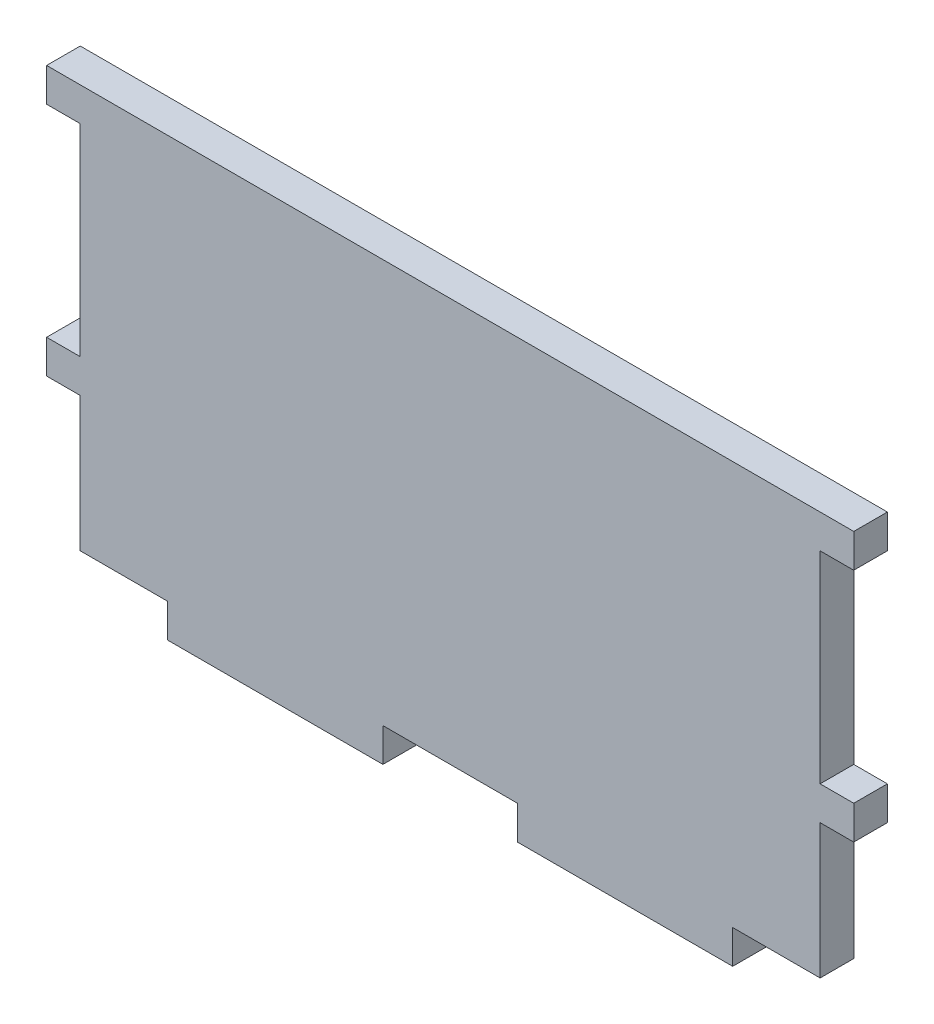
ISO-10303-21;
HEADER;
FILE_DESCRIPTION(('STEP AP214'),'2;1');
FILE_NAME('part.step','',(''),(''),'','','');
FILE_SCHEMA(('AUTOMOTIVE_DESIGN { 1 0 10303 214 1 1 1 1 }'));
ENDSEC;
DATA;
#1=APPLICATION_CONTEXT('core data for automotive mechanical design processes');
#2=APPLICATION_PROTOCOL_DEFINITION('international standard','automotive_design',2000,#1);
#3=PRODUCT_CONTEXT('',#1,'mechanical');
#4=PRODUCT('Part','Part','',(#3));
#5=PRODUCT_RELATED_PRODUCT_CATEGORY('part','',(#4));
#6=PRODUCT_DEFINITION_FORMATION('','',#4);
#7=PRODUCT_DEFINITION_CONTEXT('part definition',#1,'design');
#8=PRODUCT_DEFINITION('design','',#6,#7);
#9=PRODUCT_DEFINITION_SHAPE('','',#8);
#10=(LENGTH_UNIT() NAMED_UNIT(*) SI_UNIT(.MILLI.,.METRE.));
#11=(NAMED_UNIT(*) PLANE_ANGLE_UNIT() SI_UNIT($,.RADIAN.));
#12=(NAMED_UNIT(*) SI_UNIT($,.STERADIAN.) SOLID_ANGLE_UNIT());
#13=UNCERTAINTY_MEASURE_WITH_UNIT(LENGTH_MEASURE(1.E-05),#10,'distance_accuracy_value','');
#14=(GEOMETRIC_REPRESENTATION_CONTEXT(3) GLOBAL_UNCERTAINTY_ASSIGNED_CONTEXT((#13)) GLOBAL_UNIT_ASSIGNED_CONTEXT((#10,
#11,#12)) REPRESENTATION_CONTEXT('',''));
#15=CARTESIAN_POINT('',(0.,0.,0.));
#16=DIRECTION('',(0.,0.,1.));
#17=DIRECTION('',(1.,0.,0.));
#18=AXIS2_PLACEMENT_3D('',#15,#16,#17);
#19=CARTESIAN_POINT('',(34.925,-19.05,3.175));
#20=DIRECTION('',(0.,1.,0.));
#21=DIRECTION('',(-1.,0.,0.));
#22=AXIS2_PLACEMENT_3D('',#19,#20,#21);
#23=PLANE('',#22);
#24=DIRECTION('',(0.,0.,1.));
#25=VECTOR('',#24,1.);
#26=CARTESIAN_POINT('',(26.67,-19.05,3.17500000000001));
#27=LINE('',#26,#25);
#28=CARTESIAN_POINT('',(26.67,-19.05,0.));
#29=VERTEX_POINT('',#28);
#30=CARTESIAN_POINT('',(26.67,-19.05,3.175));
#31=VERTEX_POINT('',#30);
#32=EDGE_CURVE('E216',#29,#31,#27,.T.);
#33=ORIENTED_EDGE('',*,*,#32,.F.);
#34=DIRECTION('',(1.,0.,0.));
#35=VECTOR('',#34,1.);
#36=CARTESIAN_POINT('',(34.925,-19.05,0.));
#37=LINE('',#36,#35);
#38=CARTESIAN_POINT('',(34.925,-19.05,0.));
#39=VERTEX_POINT('',#38);
#40=EDGE_CURVE('E362',#29,#39,#37,.T.);
#41=ORIENTED_EDGE('',*,*,#40,.T.);
#42=DIRECTION('',(0.,0.,-1.));
#43=VECTOR('',#42,1.);
#44=CARTESIAN_POINT('',(34.925,-19.05,3.175));
#45=LINE('',#44,#43);
#46=CARTESIAN_POINT('',(34.925,-19.05,3.175));
#47=VERTEX_POINT('',#46);
#48=EDGE_CURVE('E41',#47,#39,#45,.T.);
#49=ORIENTED_EDGE('',*,*,#48,.F.);
#50=DIRECTION('',(1.,0.,0.));
#51=VECTOR('',#50,1.);
#52=CARTESIAN_POINT('',(34.925,-19.05,3.175));
#53=LINE('',#52,#51);
#54=EDGE_CURVE('E48',#31,#47,#53,.T.);
#55=ORIENTED_EDGE('',*,*,#54,.F.);
#56=EDGE_LOOP('',(#33,#41,#49,#55));
#57=FACE_BOUND('',#56,.T.);
#58=ADVANCED_FACE('F33',(#57),#23,.F.);
#59=DIRECTION('',(0.,0.,-1.));
#60=VECTOR('',#59,1.);
#61=CARTESIAN_POINT('',(6.35,-19.05,3.175));
#62=LINE('',#61,#60);
#63=CARTESIAN_POINT('',(6.35,-19.05,3.175));
#64=VERTEX_POINT('',#63);
#65=CARTESIAN_POINT('',(6.35,-19.05,0.));
#66=VERTEX_POINT('',#65);
#67=EDGE_CURVE('E56',#64,#66,#62,.T.);
#68=ORIENTED_EDGE('',*,*,#67,.F.);
#69=CARTESIAN_POINT('',(-6.34999999999999,-19.05,3.175));
#70=VERTEX_POINT('',#69);
#71=EDGE_CURVE('E354',#70,#64,#53,.T.);
#72=ORIENTED_EDGE('',*,*,#71,.F.);
#73=DIRECTION('',(0.,0.,1.));
#74=VECTOR('',#73,1.);
#75=CARTESIAN_POINT('',(-6.35,-19.05,3.175));
#76=LINE('',#75,#74);
#77=CARTESIAN_POINT('',(-6.34999999999999,-19.05,0.));
#78=VERTEX_POINT('',#77);
#79=EDGE_CURVE('E217',#78,#70,#76,.T.);
#80=ORIENTED_EDGE('',*,*,#79,.F.);
#81=EDGE_CURVE('E366',#78,#66,#37,.T.);
#82=ORIENTED_EDGE('',*,*,#81,.T.);
#83=EDGE_LOOP('',(#68,#72,#80,#82));
#84=FACE_BOUND('',#83,.T.);
#85=ADVANCED_FACE('F468',(#84),#23,.F.);
#86=DIRECTION('',(0.,0.,-1.));
#87=VECTOR('',#86,1.);
#88=CARTESIAN_POINT('',(-26.67,-19.05,3.175));
#89=LINE('',#88,#87);
#90=CARTESIAN_POINT('',(-26.67,-19.05,3.175));
#91=VERTEX_POINT('',#90);
#92=CARTESIAN_POINT('',(-26.67,-19.05,0.));
#93=VERTEX_POINT('',#92);
#94=EDGE_CURVE('E220',#91,#93,#89,.T.);
#95=ORIENTED_EDGE('',*,*,#94,.F.);
#96=CARTESIAN_POINT('',(-34.925,-19.05,3.175));
#97=VERTEX_POINT('',#96);
#98=EDGE_CURVE('E350',#97,#91,#53,.T.);
#99=ORIENTED_EDGE('',*,*,#98,.F.);
#100=DIRECTION('',(0.,0.,-1.));
#101=VECTOR('',#100,1.);
#102=CARTESIAN_POINT('',(-34.925,-19.05,3.175));
#103=LINE('',#102,#101);
#104=CARTESIAN_POINT('',(-34.925,-19.05,0.));
#105=VERTEX_POINT('',#104);
#106=EDGE_CURVE('E11',#97,#105,#103,.T.);
#107=ORIENTED_EDGE('',*,*,#106,.T.);
#108=EDGE_CURVE('E363',#105,#93,#37,.T.);
#109=ORIENTED_EDGE('',*,*,#108,.T.);
#110=EDGE_LOOP('',(#95,#99,#107,#109));
#111=FACE_BOUND('',#110,.T.);
#112=ADVANCED_FACE('F411',(#111),#23,.F.);
#113=CARTESIAN_POINT('',(-34.925,19.05,3.175));
#114=DIRECTION('',(1.,0.,0.));
#115=DIRECTION('',(0.,1.,0.));
#116=AXIS2_PLACEMENT_3D('',#113,#114,#115);
#117=PLANE('',#116);
#118=DIRECTION('',(0.,-1.,0.));
#119=VECTOR('',#118,1.);
#120=CARTESIAN_POINT('',(-34.925,19.05,3.175));
#121=LINE('',#120,#119);
#122=CARTESIAN_POINT('',(-34.925,-6.34999999999998,3.175));
#123=VERTEX_POINT('',#122);
#124=EDGE_CURVE('E349',#123,#97,#121,.T.);
#125=ORIENTED_EDGE('',*,*,#124,.F.);
#126=DIRECTION('',(0.,0.,-1.));
#127=VECTOR('',#126,1.);
#128=CARTESIAN_POINT('',(-34.925,-6.34999999999998,3.175));
#129=LINE('',#128,#127);
#130=CARTESIAN_POINT('',(-34.925,-6.34999999999998,0.));
#131=VERTEX_POINT('',#130);
#132=EDGE_CURVE('E271',#123,#131,#129,.T.);
#133=ORIENTED_EDGE('',*,*,#132,.T.);
#134=DIRECTION('',(0.,-1.,0.));
#135=VECTOR('',#134,1.);
#136=CARTESIAN_POINT('',(-34.925,19.05,0.));
#137=LINE('',#136,#135);
#138=EDGE_CURVE('E341',#131,#105,#137,.T.);
#139=ORIENTED_EDGE('',*,*,#138,.T.);
#140=ORIENTED_EDGE('',*,*,#106,.F.);
#141=EDGE_LOOP('',(#125,#133,#139,#140));
#142=FACE_BOUND('',#141,.T.);
#143=ADVANCED_FACE('F417',(#142),#117,.F.);
#144=CARTESIAN_POINT('',(34.925,19.05,3.175));
#145=DIRECTION('',(-1.,0.,0.));
#146=DIRECTION('',(0.,-1.,0.));
#147=AXIS2_PLACEMENT_3D('',#144,#145,#146);
#148=PLANE('',#147);
#149=DIRECTION('',(0.,1.,0.));
#150=VECTOR('',#149,1.);
#151=CARTESIAN_POINT('',(34.925,19.05,0.));
#152=LINE('',#151,#150);
#153=CARTESIAN_POINT('',(34.925,-6.34999999999998,0.));
#154=VERTEX_POINT('',#153);
#155=EDGE_CURVE('E367',#39,#154,#152,.T.);
#156=ORIENTED_EDGE('',*,*,#155,.T.);
#157=DIRECTION('',(0.,0.,-1.));
#158=VECTOR('',#157,1.);
#159=CARTESIAN_POINT('',(34.925,-6.34999999999998,3.175));
#160=LINE('',#159,#158);
#161=CARTESIAN_POINT('',(34.925,-6.34999999999998,3.175));
#162=VERTEX_POINT('',#161);
#163=EDGE_CURVE('E316',#162,#154,#160,.T.);
#164=ORIENTED_EDGE('',*,*,#163,.F.);
#165=DIRECTION('',(0.,1.,0.));
#166=VECTOR('',#165,1.);
#167=CARTESIAN_POINT('',(34.925,19.05,3.175));
#168=LINE('',#167,#166);
#169=EDGE_CURVE('E355',#47,#162,#168,.T.);
#170=ORIENTED_EDGE('',*,*,#169,.F.);
#171=ORIENTED_EDGE('',*,*,#48,.T.);
#172=EDGE_LOOP('',(#156,#164,#170,#171));
#173=FACE_BOUND('',#172,.T.);
#174=ADVANCED_FACE('F374',(#173),#148,.F.);
#175=CARTESIAN_POINT('',(34.925,-3.17499999999999,3.175));
#176=VERTEX_POINT('',#175);
#177=CARTESIAN_POINT('',(34.925,15.875,3.175));
#178=VERTEX_POINT('',#177);
#179=EDGE_CURVE('E353',#176,#178,#168,.T.);
#180=ORIENTED_EDGE('',*,*,#179,.F.);
#181=DIRECTION('',(0.,0.,-1.));
#182=VECTOR('',#181,1.);
#183=CARTESIAN_POINT('',(34.925,-3.17499999999999,3.175));
#184=LINE('',#183,#182);
#185=CARTESIAN_POINT('',(34.925,-3.17499999999999,0.));
#186=VERTEX_POINT('',#185);
#187=EDGE_CURVE('E308',#176,#186,#184,.T.);
#188=ORIENTED_EDGE('',*,*,#187,.T.);
#189=CARTESIAN_POINT('',(34.925,15.875,0.));
#190=VERTEX_POINT('',#189);
#191=EDGE_CURVE('E365',#186,#190,#152,.T.);
#192=ORIENTED_EDGE('',*,*,#191,.T.);
#193=DIRECTION('',(0.,0.,-1.));
#194=VECTOR('',#193,1.);
#195=CARTESIAN_POINT('',(34.925,15.875,3.175));
#196=LINE('',#195,#194);
#197=EDGE_CURVE('E338',#178,#190,#196,.T.);
#198=ORIENTED_EDGE('',*,*,#197,.F.);
#199=EDGE_LOOP('',(#180,#188,#192,#198));
#200=FACE_BOUND('',#199,.T.);
#201=ADVANCED_FACE('F451',(#200),#148,.F.);
#202=CARTESIAN_POINT('',(-34.925,15.875,0.));
#203=VERTEX_POINT('',#202);
#204=CARTESIAN_POINT('',(-34.925,-3.17499999999999,0.));
#205=VERTEX_POINT('',#204);
#206=EDGE_CURVE('E360',#203,#205,#137,.T.);
#207=ORIENTED_EDGE('',*,*,#206,.T.);
#208=DIRECTION('',(0.,0.,-1.));
#209=VECTOR('',#208,1.);
#210=CARTESIAN_POINT('',(-34.925,-3.17499999999999,3.175));
#211=LINE('',#210,#209);
#212=CARTESIAN_POINT('',(-34.925,-3.17499999999999,3.175));
#213=VERTEX_POINT('',#212);
#214=EDGE_CURVE('E274',#213,#205,#211,.T.);
#215=ORIENTED_EDGE('',*,*,#214,.F.);
#216=CARTESIAN_POINT('',(-34.925,15.875,3.175));
#217=VERTEX_POINT('',#216);
#218=EDGE_CURVE('E346',#217,#213,#121,.T.);
#219=ORIENTED_EDGE('',*,*,#218,.F.);
#220=DIRECTION('',(0.,0.,-1.));
#221=VECTOR('',#220,1.);
#222=CARTESIAN_POINT('',(-34.925,15.875,3.175));
#223=LINE('',#222,#221);
#224=EDGE_CURVE('E293',#217,#203,#223,.T.);
#225=ORIENTED_EDGE('',*,*,#224,.T.);
#226=EDGE_LOOP('',(#207,#215,#219,#225));
#227=FACE_BOUND('',#226,.T.);
#228=ADVANCED_FACE('F35',(#227),#117,.F.);
#229=CARTESIAN_POINT('',(34.925,19.05,3.175));
#230=DIRECTION('',(0.,-1.,0.));
#231=DIRECTION('',(1.,0.,0.));
#232=AXIS2_PLACEMENT_3D('',#229,#230,#231);
#233=PLANE('',#232);
#234=DIRECTION('',(-1.,0.,0.));
#235=VECTOR('',#234,1.);
#236=CARTESIAN_POINT('',(34.925,19.05,0.));
#237=LINE('',#236,#235);
#238=CARTESIAN_POINT('',(38.1,19.05,0.));
#239=VERTEX_POINT('',#238);
#240=CARTESIAN_POINT('',(-38.1,19.05,0.));
#241=VERTEX_POINT('',#240);
#242=EDGE_CURVE('E369',#239,#241,#237,.T.);
#243=ORIENTED_EDGE('',*,*,#242,.T.);
#244=DIRECTION('',(0.,0.,-1.));
#245=VECTOR('',#244,1.);
#246=CARTESIAN_POINT('',(-38.1,19.05,3.175));
#247=LINE('',#246,#245);
#248=CARTESIAN_POINT('',(-38.1,19.05,3.175));
#249=VERTEX_POINT('',#248);
#250=EDGE_CURVE('E285',#249,#241,#247,.T.);
#251=ORIENTED_EDGE('',*,*,#250,.F.);
#252=DIRECTION('',(-1.,0.,0.));
#253=VECTOR('',#252,1.);
#254=CARTESIAN_POINT('',(34.925,19.05,3.175));
#255=LINE('',#254,#253);
#256=CARTESIAN_POINT('',(38.1,19.05,3.175));
#257=VERTEX_POINT('',#256);
#258=EDGE_CURVE('E358',#257,#249,#255,.T.);
#259=ORIENTED_EDGE('',*,*,#258,.F.);
#260=DIRECTION('',(0.,0.,-1.));
#261=VECTOR('',#260,1.);
#262=CARTESIAN_POINT('',(38.1,19.05,3.175));
#263=LINE('',#262,#261);
#264=EDGE_CURVE('E333',#257,#239,#263,.T.);
#265=ORIENTED_EDGE('',*,*,#264,.T.);
#266=EDGE_LOOP('',(#243,#251,#259,#265));
#267=FACE_BOUND('',#266,.T.);
#268=ADVANCED_FACE('F439',(#267),#233,.F.);
#269=CARTESIAN_POINT('',(0.,0.,3.175));
#270=DIRECTION('',(0.,0.,-1.));
#271=DIRECTION('',(-1.,0.,0.));
#272=AXIS2_PLACEMENT_3D('',#269,#270,#271);
#273=PLANE('',#272);
#274=ORIENTED_EDGE('',*,*,#258,.T.);
#275=DIRECTION('',(0.,1.,0.));
#276=VECTOR('',#275,1.);
#277=CARTESIAN_POINT('',(-38.1,19.05,3.175));
#278=LINE('',#277,#276);
#279=CARTESIAN_POINT('',(-38.1,15.875,3.175));
#280=VERTEX_POINT('',#279);
#281=EDGE_CURVE('E278',#280,#249,#278,.T.);
#282=ORIENTED_EDGE('',*,*,#281,.F.);
#283=DIRECTION('',(-1.,0.,0.));
#284=VECTOR('',#283,1.);
#285=CARTESIAN_POINT('',(-38.1,15.875,3.175));
#286=LINE('',#285,#284);
#287=EDGE_CURVE('E281',#217,#280,#286,.T.);
#288=ORIENTED_EDGE('',*,*,#287,.F.);
#289=ORIENTED_EDGE('',*,*,#218,.T.);
#290=DIRECTION('',(1.,0.,0.));
#291=VECTOR('',#290,1.);
#292=CARTESIAN_POINT('',(-38.1,-3.17499999999999,3.175));
#293=LINE('',#292,#291);
#294=CARTESIAN_POINT('',(-38.1,-3.17499999999999,3.175));
#295=VERTEX_POINT('',#294);
#296=EDGE_CURVE('E253',#295,#213,#293,.T.);
#297=ORIENTED_EDGE('',*,*,#296,.F.);
#298=DIRECTION('',(0.,1.,0.));
#299=VECTOR('',#298,1.);
#300=CARTESIAN_POINT('',(-38.1,-3.17499999999999,3.175));
#301=LINE('',#300,#299);
#302=CARTESIAN_POINT('',(-38.1,-6.34999999999998,3.175));
#303=VERTEX_POINT('',#302);
#304=EDGE_CURVE('E250',#303,#295,#301,.T.);
#305=ORIENTED_EDGE('',*,*,#304,.F.);
#306=DIRECTION('',(-1.,0.,0.));
#307=VECTOR('',#306,1.);
#308=CARTESIAN_POINT('',(-38.1,-6.34999999999998,3.175));
#309=LINE('',#308,#307);
#310=EDGE_CURVE('E257',#123,#303,#309,.T.);
#311=ORIENTED_EDGE('',*,*,#310,.F.);
#312=ORIENTED_EDGE('',*,*,#124,.T.);
#313=ORIENTED_EDGE('',*,*,#98,.T.);
#314=DIRECTION('',(0.,1.,0.));
#315=VECTOR('',#314,1.);
#316=CARTESIAN_POINT('',(-26.67,-22.225,3.175));
#317=LINE('',#316,#315);
#318=CARTESIAN_POINT('',(-26.67,-22.225,3.175));
#319=VERTEX_POINT('',#318);
#320=EDGE_CURVE('E243',#319,#91,#317,.T.);
#321=ORIENTED_EDGE('',*,*,#320,.F.);
#322=DIRECTION('',(-1.,0.,0.));
#323=VECTOR('',#322,1.);
#324=CARTESIAN_POINT('',(-26.67,-22.225,3.175));
#325=LINE('',#324,#323);
#326=CARTESIAN_POINT('',(-6.35,-22.225,3.175));
#327=VERTEX_POINT('',#326);
#328=EDGE_CURVE('E229',#327,#319,#325,.T.);
#329=ORIENTED_EDGE('',*,*,#328,.F.);
#330=DIRECTION('',(0.,1.,0.));
#331=VECTOR('',#330,1.);
#332=CARTESIAN_POINT('',(-6.35,-22.225,3.175));
#333=LINE('',#332,#331);
#334=EDGE_CURVE('E246',#327,#70,#333,.T.);
#335=ORIENTED_EDGE('',*,*,#334,.T.);
#336=ORIENTED_EDGE('',*,*,#71,.T.);
#337=DIRECTION('',(0.,1.,0.));
#338=VECTOR('',#337,1.);
#339=CARTESIAN_POINT('',(6.35,-22.225,3.175));
#340=LINE('',#339,#338);
#341=CARTESIAN_POINT('',(6.35,-22.225,3.175));
#342=VERTEX_POINT('',#341);
#343=EDGE_CURVE('E201',#342,#64,#340,.T.);
#344=ORIENTED_EDGE('',*,*,#343,.F.);
#345=DIRECTION('',(-1.,0.,0.));
#346=VECTOR('',#345,1.);
#347=CARTESIAN_POINT('',(26.67,-22.225,3.17500000000001));
#348=LINE('',#347,#346);
#349=CARTESIAN_POINT('',(26.67,-22.225,3.17500000000001));
#350=VERTEX_POINT('',#349);
#351=EDGE_CURVE('E194',#350,#342,#348,.T.);
#352=ORIENTED_EDGE('',*,*,#351,.F.);
#353=DIRECTION('',(0.,1.,0.));
#354=VECTOR('',#353,1.);
#355=CARTESIAN_POINT('',(26.67,-22.225,3.17500000000001));
#356=LINE('',#355,#354);
#357=EDGE_CURVE('E198',#350,#31,#356,.T.);
#358=ORIENTED_EDGE('',*,*,#357,.T.);
#359=ORIENTED_EDGE('',*,*,#54,.T.);
#360=ORIENTED_EDGE('',*,*,#169,.T.);
#361=DIRECTION('',(-1.,0.,0.));
#362=VECTOR('',#361,1.);
#363=CARTESIAN_POINT('',(38.1,-6.34999999999998,3.175));
#364=LINE('',#363,#362);
#365=CARTESIAN_POINT('',(38.1,-6.34999999999998,3.175));
#366=VERTEX_POINT('',#365);
#367=EDGE_CURVE('E305',#366,#162,#364,.T.);
#368=ORIENTED_EDGE('',*,*,#367,.F.);
#369=DIRECTION('',(0.,-1.,0.));
#370=VECTOR('',#369,1.);
#371=CARTESIAN_POINT('',(38.1,-3.17499999999999,3.175));
#372=LINE('',#371,#370);
#373=CARTESIAN_POINT('',(38.1,-3.17499999999999,3.175));
#374=VERTEX_POINT('',#373);
#375=EDGE_CURVE('E301',#374,#366,#372,.T.);
#376=ORIENTED_EDGE('',*,*,#375,.F.);
#377=DIRECTION('',(1.,0.,0.));
#378=VECTOR('',#377,1.);
#379=CARTESIAN_POINT('',(38.1,-3.17499999999999,3.175));
#380=LINE('',#379,#378);
#381=EDGE_CURVE('E298',#176,#374,#380,.T.);
#382=ORIENTED_EDGE('',*,*,#381,.F.);
#383=ORIENTED_EDGE('',*,*,#179,.T.);
#384=DIRECTION('',(-1.,0.,0.));
#385=VECTOR('',#384,1.);
#386=CARTESIAN_POINT('',(38.1,15.875,3.175));
#387=LINE('',#386,#385);
#388=CARTESIAN_POINT('',(38.1,15.875,3.175));
#389=VERTEX_POINT('',#388);
#390=EDGE_CURVE('E329',#389,#178,#387,.T.);
#391=ORIENTED_EDGE('',*,*,#390,.F.);
#392=DIRECTION('',(0.,-1.,0.));
#393=VECTOR('',#392,1.);
#394=CARTESIAN_POINT('',(38.1,19.05,3.175));
#395=LINE('',#394,#393);
#396=EDGE_CURVE('E326',#257,#389,#395,.T.);
#397=ORIENTED_EDGE('',*,*,#396,.F.);
#398=EDGE_LOOP('',(#274,#282,#288,#289,#297,#305,#311,#312,#313,#321,#329,#335,#336,#344,#352,
#358,#359,#360,#368,#376,#382,#383,#391,#397));
#399=FACE_BOUND('',#398,.T.);
#400=ADVANCED_FACE('F196',(#399),#273,.F.);
#401=CARTESIAN_POINT('',(0.,0.,0.));
#402=DIRECTION('',(0.,0.,-1.));
#403=DIRECTION('',(-1.,0.,0.));
#404=AXIS2_PLACEMENT_3D('',#401,#402,#403);
#405=PLANE('',#404);
#406=ORIENTED_EDGE('',*,*,#206,.F.);
#407=DIRECTION('',(-1.,0.,0.));
#408=VECTOR('',#407,1.);
#409=CARTESIAN_POINT('',(-38.1,15.875,0.));
#410=LINE('',#409,#408);
#411=CARTESIAN_POINT('',(-38.1,15.875,0.));
#412=VERTEX_POINT('',#411);
#413=EDGE_CURVE('E282',#203,#412,#410,.T.);
#414=ORIENTED_EDGE('',*,*,#413,.T.);
#415=DIRECTION('',(0.,1.,0.));
#416=VECTOR('',#415,1.);
#417=CARTESIAN_POINT('',(-38.1,19.05,0.));
#418=LINE('',#417,#416);
#419=EDGE_CURVE('E270',#412,#241,#418,.T.);
#420=ORIENTED_EDGE('',*,*,#419,.T.);
#421=ORIENTED_EDGE('',*,*,#242,.F.);
#422=DIRECTION('',(0.,-1.,0.));
#423=VECTOR('',#422,1.);
#424=CARTESIAN_POINT('',(38.1,19.05,0.));
#425=LINE('',#424,#423);
#426=CARTESIAN_POINT('',(38.1,15.875,0.));
#427=VERTEX_POINT('',#426);
#428=EDGE_CURVE('E319',#239,#427,#425,.T.);
#429=ORIENTED_EDGE('',*,*,#428,.T.);
#430=DIRECTION('',(-1.,0.,0.));
#431=VECTOR('',#430,1.);
#432=CARTESIAN_POINT('',(38.1,15.875,0.));
#433=LINE('',#432,#431);
#434=EDGE_CURVE('E330',#427,#190,#433,.T.);
#435=ORIENTED_EDGE('',*,*,#434,.T.);
#436=ORIENTED_EDGE('',*,*,#191,.F.);
#437=DIRECTION('',(1.,0.,0.));
#438=VECTOR('',#437,1.);
#439=CARTESIAN_POINT('',(38.1,-3.17499999999999,0.));
#440=LINE('',#439,#438);
#441=CARTESIAN_POINT('',(38.1,-3.17499999999999,0.));
#442=VERTEX_POINT('',#441);
#443=EDGE_CURVE('E292',#186,#442,#440,.T.);
#444=ORIENTED_EDGE('',*,*,#443,.T.);
#445=DIRECTION('',(0.,-1.,0.));
#446=VECTOR('',#445,1.);
#447=CARTESIAN_POINT('',(38.1,-3.17499999999999,0.));
#448=LINE('',#447,#446);
#449=CARTESIAN_POINT('',(38.1,-6.34999999999998,0.));
#450=VERTEX_POINT('',#449);
#451=EDGE_CURVE('E311',#442,#450,#448,.T.);
#452=ORIENTED_EDGE('',*,*,#451,.T.);
#453=DIRECTION('',(-1.,0.,0.));
#454=VECTOR('',#453,1.);
#455=CARTESIAN_POINT('',(38.1,-6.34999999999998,0.));
#456=LINE('',#455,#454);
#457=EDGE_CURVE('E302',#450,#154,#456,.T.);
#458=ORIENTED_EDGE('',*,*,#457,.T.);
#459=ORIENTED_EDGE('',*,*,#155,.F.);
#460=ORIENTED_EDGE('',*,*,#40,.F.);
#461=DIRECTION('',(0.,1.,0.));
#462=VECTOR('',#461,1.);
#463=CARTESIAN_POINT('',(26.67,-22.225,0.));
#464=LINE('',#463,#462);
#465=CARTESIAN_POINT('',(26.67,-22.225,0.));
#466=VERTEX_POINT('',#465);
#467=EDGE_CURVE('E390',#466,#29,#464,.T.);
#468=ORIENTED_EDGE('',*,*,#467,.F.);
#469=DIRECTION('',(1.,0.,0.));
#470=VECTOR('',#469,1.);
#471=CARTESIAN_POINT('',(26.67,-22.225,0.));
#472=LINE('',#471,#470);
#473=CARTESIAN_POINT('',(6.35,-22.225,0.));
#474=VERTEX_POINT('',#473);
#475=EDGE_CURVE('E210',#474,#466,#472,.T.);
#476=ORIENTED_EDGE('',*,*,#475,.F.);
#477=DIRECTION('',(0.,1.,0.));
#478=VECTOR('',#477,1.);
#479=CARTESIAN_POINT('',(6.35,-22.225,0.));
#480=LINE('',#479,#478);
#481=EDGE_CURVE('E222',#474,#66,#480,.T.);
#482=ORIENTED_EDGE('',*,*,#481,.T.);
#483=ORIENTED_EDGE('',*,*,#81,.F.);
#484=DIRECTION('',(0.,1.,0.));
#485=VECTOR('',#484,1.);
#486=CARTESIAN_POINT('',(-6.35,-22.225,0.));
#487=LINE('',#486,#485);
#488=CARTESIAN_POINT('',(-6.35,-22.225,0.));
#489=VERTEX_POINT('',#488);
#490=EDGE_CURVE('E234',#489,#78,#487,.T.);
#491=ORIENTED_EDGE('',*,*,#490,.F.);
#492=DIRECTION('',(1.,0.,0.));
#493=VECTOR('',#492,1.);
#494=CARTESIAN_POINT('',(-26.67,-22.225,0.));
#495=LINE('',#494,#493);
#496=CARTESIAN_POINT('',(-26.67,-22.225,0.));
#497=VERTEX_POINT('',#496);
#498=EDGE_CURVE('E233',#497,#489,#495,.T.);
#499=ORIENTED_EDGE('',*,*,#498,.F.);
#500=DIRECTION('',(0.,1.,0.));
#501=VECTOR('',#500,1.);
#502=CARTESIAN_POINT('',(-26.67,-22.225,0.));
#503=LINE('',#502,#501);
#504=EDGE_CURVE('E240',#497,#93,#503,.T.);
#505=ORIENTED_EDGE('',*,*,#504,.T.);
#506=ORIENTED_EDGE('',*,*,#108,.F.);
#507=ORIENTED_EDGE('',*,*,#138,.F.);
#508=DIRECTION('',(-1.,0.,0.));
#509=VECTOR('',#508,1.);
#510=CARTESIAN_POINT('',(-38.1,-6.34999999999998,0.));
#511=LINE('',#510,#509);
#512=CARTESIAN_POINT('',(-38.1,-6.34999999999998,0.));
#513=VERTEX_POINT('',#512);
#514=EDGE_CURVE('E254',#131,#513,#511,.T.);
#515=ORIENTED_EDGE('',*,*,#514,.T.);
#516=DIRECTION('',(0.,1.,0.));
#517=VECTOR('',#516,1.);
#518=CARTESIAN_POINT('',(-38.1,-3.17499999999999,0.));
#519=LINE('',#518,#517);
#520=CARTESIAN_POINT('',(-38.1,-3.17499999999999,0.));
#521=VERTEX_POINT('',#520);
#522=EDGE_CURVE('E249',#513,#521,#519,.T.);
#523=ORIENTED_EDGE('',*,*,#522,.T.);
#524=DIRECTION('',(1.,0.,0.));
#525=VECTOR('',#524,1.);
#526=CARTESIAN_POINT('',(-38.1,-3.17499999999999,0.));
#527=LINE('',#526,#525);
#528=EDGE_CURVE('E263',#521,#205,#527,.T.);
#529=ORIENTED_EDGE('',*,*,#528,.T.);
#530=EDGE_LOOP('',(#406,#414,#420,#421,#429,#435,#436,#444,#452,#458,#459,#460,#468,#476,#482,
#483,#491,#499,#505,#506,#507,#515,#523,#529));
#531=FACE_BOUND('',#530,.T.);
#532=ADVANCED_FACE('F377',(#531),#405,.T.);
#533=CARTESIAN_POINT('',(38.1,15.875,3.175));
#534=DIRECTION('',(0.,-1.,0.));
#535=DIRECTION('',(0.,0.,-1.));
#536=AXIS2_PLACEMENT_3D('',#533,#534,#535);
#537=PLANE('',#536);
#538=ORIENTED_EDGE('',*,*,#434,.F.);
#539=DIRECTION('',(0.,0.,-1.));
#540=VECTOR('',#539,1.);
#541=CARTESIAN_POINT('',(38.1,15.875,3.175));
#542=LINE('',#541,#540);
#543=EDGE_CURVE('E342',#389,#427,#542,.T.);
#544=ORIENTED_EDGE('',*,*,#543,.F.);
#545=ORIENTED_EDGE('',*,*,#390,.T.);
#546=ORIENTED_EDGE('',*,*,#197,.T.);
#547=EDGE_LOOP('',(#538,#544,#545,#546));
#548=FACE_BOUND('',#547,.T.);
#549=ADVANCED_FACE('F447',(#548),#537,.T.);
#550=CARTESIAN_POINT('',(38.1,19.05,3.175));
#551=DIRECTION('',(1.,0.,0.));
#552=DIRECTION('',(0.,0.,-1.));
#553=AXIS2_PLACEMENT_3D('',#550,#551,#552);
#554=PLANE('',#553);
#555=ORIENTED_EDGE('',*,*,#428,.F.);
#556=ORIENTED_EDGE('',*,*,#264,.F.);
#557=ORIENTED_EDGE('',*,*,#396,.T.);
#558=ORIENTED_EDGE('',*,*,#543,.T.);
#559=EDGE_LOOP('',(#555,#556,#557,#558));
#560=FACE_BOUND('',#559,.T.);
#561=ADVANCED_FACE('F444',(#560),#554,.T.);
#562=CARTESIAN_POINT('',(38.1,-6.34999999999998,3.175));
#563=DIRECTION('',(0.,-1.,0.));
#564=DIRECTION('',(0.,0.,-1.));
#565=AXIS2_PLACEMENT_3D('',#562,#563,#564);
#566=PLANE('',#565);
#567=ORIENTED_EDGE('',*,*,#457,.F.);
#568=DIRECTION('',(0.,0.,-1.));
#569=VECTOR('',#568,1.);
#570=CARTESIAN_POINT('',(38.1,-6.34999999999998,3.175));
#571=LINE('',#570,#569);
#572=EDGE_CURVE('E320',#366,#450,#571,.T.);
#573=ORIENTED_EDGE('',*,*,#572,.F.);
#574=ORIENTED_EDGE('',*,*,#367,.T.);
#575=ORIENTED_EDGE('',*,*,#163,.T.);
#576=EDGE_LOOP('',(#567,#573,#574,#575));
#577=FACE_BOUND('',#576,.T.);
#578=ADVANCED_FACE('F381',(#577),#566,.T.);
#579=CARTESIAN_POINT('',(38.1,-3.17499999999999,3.175));
#580=DIRECTION('',(1.,0.,0.));
#581=DIRECTION('',(0.,0.,-1.));
#582=AXIS2_PLACEMENT_3D('',#579,#580,#581);
#583=PLANE('',#582);
#584=ORIENTED_EDGE('',*,*,#451,.F.);
#585=DIRECTION('',(0.,0.,-1.));
#586=VECTOR('',#585,1.);
#587=CARTESIAN_POINT('',(38.1,-3.17499999999999,3.175));
#588=LINE('',#587,#586);
#589=EDGE_CURVE('E322',#374,#442,#588,.T.);
#590=ORIENTED_EDGE('',*,*,#589,.F.);
#591=ORIENTED_EDGE('',*,*,#375,.T.);
#592=ORIENTED_EDGE('',*,*,#572,.T.);
#593=EDGE_LOOP('',(#584,#590,#591,#592));
#594=FACE_BOUND('',#593,.T.);
#595=ADVANCED_FACE('F458',(#594),#583,.T.);
#596=CARTESIAN_POINT('',(38.1,-3.17499999999999,3.175));
#597=DIRECTION('',(0.,1.,0.));
#598=DIRECTION('',(0.,0.,1.));
#599=AXIS2_PLACEMENT_3D('',#596,#597,#598);
#600=PLANE('',#599);
#601=ORIENTED_EDGE('',*,*,#443,.F.);
#602=ORIENTED_EDGE('',*,*,#187,.F.);
#603=ORIENTED_EDGE('',*,*,#381,.T.);
#604=ORIENTED_EDGE('',*,*,#589,.T.);
#605=EDGE_LOOP('',(#601,#602,#603,#604));
#606=FACE_BOUND('',#605,.T.);
#607=ADVANCED_FACE('F455',(#606),#600,.T.);
#608=CARTESIAN_POINT('',(-38.1,19.05,3.175));
#609=DIRECTION('',(-1.,0.,0.));
#610=DIRECTION('',(0.,0.,1.));
#611=AXIS2_PLACEMENT_3D('',#608,#609,#610);
#612=PLANE('',#611);
#613=ORIENTED_EDGE('',*,*,#419,.F.);
#614=DIRECTION('',(0.,0.,-1.));
#615=VECTOR('',#614,1.);
#616=CARTESIAN_POINT('',(-38.1,15.875,3.175));
#617=LINE('',#616,#615);
#618=EDGE_CURVE('E290',#280,#412,#617,.T.);
#619=ORIENTED_EDGE('',*,*,#618,.F.);
#620=ORIENTED_EDGE('',*,*,#281,.T.);
#621=ORIENTED_EDGE('',*,*,#250,.T.);
#622=EDGE_LOOP('',(#613,#619,#620,#621));
#623=FACE_BOUND('',#622,.T.);
#624=ADVANCED_FACE('F436',(#623),#612,.T.);
#625=CARTESIAN_POINT('',(-38.1,15.875,3.175));
#626=DIRECTION('',(0.,-1.,0.));
#627=DIRECTION('',(0.,0.,-1.));
#628=AXIS2_PLACEMENT_3D('',#625,#626,#627);
#629=PLANE('',#628);
#630=ORIENTED_EDGE('',*,*,#413,.F.);
#631=ORIENTED_EDGE('',*,*,#224,.F.);
#632=ORIENTED_EDGE('',*,*,#287,.T.);
#633=ORIENTED_EDGE('',*,*,#618,.T.);
#634=EDGE_LOOP('',(#630,#631,#632,#633));
#635=FACE_BOUND('',#634,.T.);
#636=ADVANCED_FACE('F433',(#635),#629,.T.);
#637=CARTESIAN_POINT('',(-38.1,-3.17499999999999,3.175));
#638=DIRECTION('',(-1.,0.,0.));
#639=DIRECTION('',(0.,0.,1.));
#640=AXIS2_PLACEMENT_3D('',#637,#638,#639);
#641=PLANE('',#640);
#642=ORIENTED_EDGE('',*,*,#522,.F.);
#643=DIRECTION('',(0.,0.,-1.));
#644=VECTOR('',#643,1.);
#645=CARTESIAN_POINT('',(-38.1,-6.34999999999998,3.175));
#646=LINE('',#645,#644);
#647=EDGE_CURVE('E268',#303,#513,#646,.T.);
#648=ORIENTED_EDGE('',*,*,#647,.F.);
#649=ORIENTED_EDGE('',*,*,#304,.T.);
#650=DIRECTION('',(0.,0.,-1.));
#651=VECTOR('',#650,1.);
#652=CARTESIAN_POINT('',(-38.1,-3.17499999999999,3.175));
#653=LINE('',#652,#651);
#654=EDGE_CURVE('E260',#295,#521,#653,.T.);
#655=ORIENTED_EDGE('',*,*,#654,.T.);
#656=EDGE_LOOP('',(#642,#648,#649,#655));
#657=FACE_BOUND('',#656,.T.);
#658=ADVANCED_FACE('F424',(#657),#641,.T.);
#659=CARTESIAN_POINT('',(-38.1,-6.34999999999998,3.175));
#660=DIRECTION('',(0.,-1.,0.));
#661=DIRECTION('',(0.,0.,-1.));
#662=AXIS2_PLACEMENT_3D('',#659,#660,#661);
#663=PLANE('',#662);
#664=ORIENTED_EDGE('',*,*,#514,.F.);
#665=ORIENTED_EDGE('',*,*,#132,.F.);
#666=ORIENTED_EDGE('',*,*,#310,.T.);
#667=ORIENTED_EDGE('',*,*,#647,.T.);
#668=EDGE_LOOP('',(#664,#665,#666,#667));
#669=FACE_BOUND('',#668,.T.);
#670=ADVANCED_FACE('F420',(#669),#663,.T.);
#671=CARTESIAN_POINT('',(-38.1,-3.17499999999999,3.175));
#672=DIRECTION('',(0.,1.,0.));
#673=DIRECTION('',(0.,0.,1.));
#674=AXIS2_PLACEMENT_3D('',#671,#672,#673);
#675=PLANE('',#674);
#676=ORIENTED_EDGE('',*,*,#528,.F.);
#677=ORIENTED_EDGE('',*,*,#654,.F.);
#678=ORIENTED_EDGE('',*,*,#296,.T.);
#679=ORIENTED_EDGE('',*,*,#214,.T.);
#680=EDGE_LOOP('',(#676,#677,#678,#679));
#681=FACE_BOUND('',#680,.T.);
#682=ADVANCED_FACE('F427',(#681),#675,.T.);
#683=CARTESIAN_POINT('',(-6.35,-22.225,3.175));
#684=DIRECTION('',(-1.,0.,0.));
#685=DIRECTION('',(0.,-1.,0.));
#686=AXIS2_PLACEMENT_3D('',#683,#684,#685);
#687=PLANE('',#686);
#688=ORIENTED_EDGE('',*,*,#79,.T.);
#689=ORIENTED_EDGE('',*,*,#334,.F.);
#690=DIRECTION('',(0.,0.,1.));
#691=VECTOR('',#690,1.);
#692=CARTESIAN_POINT('',(-6.35,-22.225,3.175));
#693=LINE('',#692,#691);
#694=EDGE_CURVE('E226',#489,#327,#693,.T.);
#695=ORIENTED_EDGE('',*,*,#694,.F.);
#696=ORIENTED_EDGE('',*,*,#490,.T.);
#697=EDGE_LOOP('',(#688,#689,#695,#696));
#698=FACE_BOUND('',#697,.T.);
#699=ADVANCED_FACE('F400',(#698),#687,.F.);
#700=CARTESIAN_POINT('',(-26.67,-22.225,3.175));
#701=DIRECTION('',(1.,0.,0.));
#702=DIRECTION('',(0.,1.,0.));
#703=AXIS2_PLACEMENT_3D('',#700,#701,#702);
#704=PLANE('',#703);
#705=ORIENTED_EDGE('',*,*,#94,.T.);
#706=ORIENTED_EDGE('',*,*,#504,.F.);
#707=DIRECTION('',(0.,0.,-1.));
#708=VECTOR('',#707,1.);
#709=CARTESIAN_POINT('',(-26.67,-22.225,3.175));
#710=LINE('',#709,#708);
#711=EDGE_CURVE('E231',#319,#497,#710,.T.);
#712=ORIENTED_EDGE('',*,*,#711,.F.);
#713=ORIENTED_EDGE('',*,*,#320,.T.);
#714=EDGE_LOOP('',(#705,#706,#712,#713));
#715=FACE_BOUND('',#714,.T.);
#716=ADVANCED_FACE('F408',(#715),#704,.F.);
#717=CARTESIAN_POINT('',(0.,-22.225,0.));
#718=DIRECTION('',(0.,-1.,0.));
#719=DIRECTION('',(1.,0.,0.));
#720=AXIS2_PLACEMENT_3D('',#717,#718,#719);
#721=PLANE('',#720);
#722=ORIENTED_EDGE('',*,*,#694,.T.);
#723=ORIENTED_EDGE('',*,*,#328,.T.);
#724=ORIENTED_EDGE('',*,*,#711,.T.);
#725=ORIENTED_EDGE('',*,*,#498,.T.);
#726=EDGE_LOOP('',(#722,#723,#724,#725));
#727=FACE_BOUND('',#726,.T.);
#728=ADVANCED_FACE('F402',(#727),#721,.T.);
#729=CARTESIAN_POINT('',(26.67,-22.225,3.17500000000001));
#730=DIRECTION('',(-1.,0.,0.));
#731=DIRECTION('',(0.,0.,1.));
#732=AXIS2_PLACEMENT_3D('',#729,#730,#731);
#733=PLANE('',#732);
#734=ORIENTED_EDGE('',*,*,#32,.T.);
#735=ORIENTED_EDGE('',*,*,#357,.F.);
#736=DIRECTION('',(0.,0.,1.));
#737=VECTOR('',#736,1.);
#738=CARTESIAN_POINT('',(26.67,-22.225,3.17500000000001));
#739=LINE('',#738,#737);
#740=EDGE_CURVE('E205',#466,#350,#739,.T.);
#741=ORIENTED_EDGE('',*,*,#740,.F.);
#742=ORIENTED_EDGE('',*,*,#467,.T.);
#743=EDGE_LOOP('',(#734,#735,#741,#742));
#744=FACE_BOUND('',#743,.T.);
#745=ADVANCED_FACE('F215',(#744),#733,.F.);
#746=CARTESIAN_POINT('',(6.35,-22.225,3.175));
#747=DIRECTION('',(1.,0.,0.));
#748=DIRECTION('',(0.,1.,0.));
#749=AXIS2_PLACEMENT_3D('',#746,#747,#748);
#750=PLANE('',#749);
#751=ORIENTED_EDGE('',*,*,#67,.T.);
#752=ORIENTED_EDGE('',*,*,#481,.F.);
#753=DIRECTION('',(0.,0.,-1.));
#754=VECTOR('',#753,1.);
#755=CARTESIAN_POINT('',(6.35,-22.225,3.175));
#756=LINE('',#755,#754);
#757=EDGE_CURVE('E204',#342,#474,#756,.T.);
#758=ORIENTED_EDGE('',*,*,#757,.F.);
#759=ORIENTED_EDGE('',*,*,#343,.T.);
#760=EDGE_LOOP('',(#751,#752,#758,#759));
#761=FACE_BOUND('',#760,.T.);
#762=ADVANCED_FACE('F386',(#761),#750,.F.);
#763=CARTESIAN_POINT('',(0.,-22.225,0.));
#764=DIRECTION('',(0.,1.,0.));
#765=DIRECTION('',(-1.,0.,0.));
#766=AXIS2_PLACEMENT_3D('',#763,#764,#765);
#767=PLANE('',#766);
#768=ORIENTED_EDGE('',*,*,#740,.T.);
#769=ORIENTED_EDGE('',*,*,#351,.T.);
#770=ORIENTED_EDGE('',*,*,#757,.T.);
#771=ORIENTED_EDGE('',*,*,#475,.T.);
#772=EDGE_LOOP('',(#768,#769,#770,#771));
#773=FACE_BOUND('',#772,.T.);
#774=ADVANCED_FACE('F208',(#773),#767,.F.);
#775=CLOSED_SHELL('',(#58,#85,#112,#143,#174,#201,#228,#268,#400,#532,#549,#561,#578,#595,#607,
#624,#636,#658,#670,#682,#699,#716,#728,#745,#762,#774));
#776=MANIFOLD_SOLID_BREP('B2',#775);
#777=ADVANCED_BREP_SHAPE_REPRESENTATION('',(#18,#776),#14);
#778=SHAPE_DEFINITION_REPRESENTATION(#9,#777);
ENDSEC;
END-ISO-10303-21;
